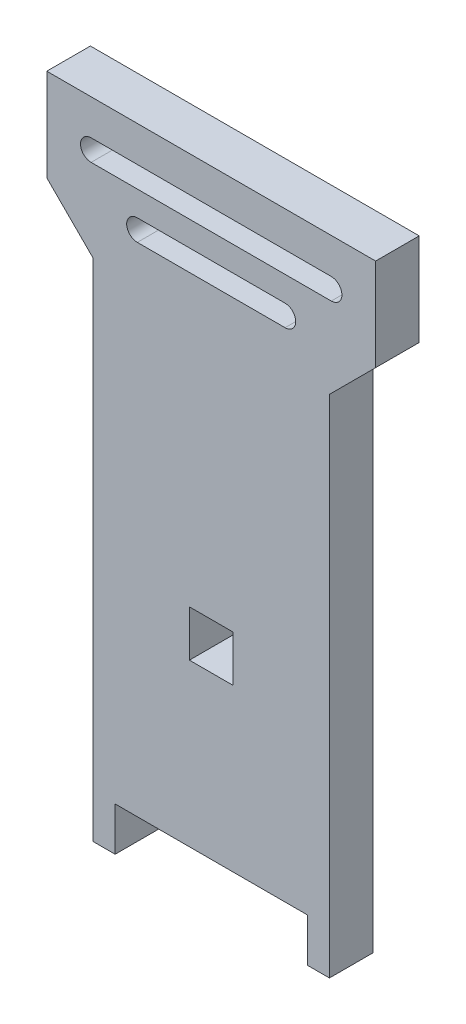
ISO-10303-21;
HEADER;
FILE_DESCRIPTION(('STEP AP214'),'2;1');
FILE_NAME('part.step','',(''),(''),'','','');
FILE_SCHEMA(('AUTOMOTIVE_DESIGN { 1 0 10303 214 1 1 1 1 }'));
ENDSEC;
DATA;
#1=APPLICATION_CONTEXT('core data for automotive mechanical design processes');
#2=APPLICATION_PROTOCOL_DEFINITION('international standard','automotive_design',2000,#1);
#3=PRODUCT_CONTEXT('',#1,'mechanical');
#4=PRODUCT('Part','Part','',(#3));
#5=PRODUCT_RELATED_PRODUCT_CATEGORY('part','',(#4));
#6=PRODUCT_DEFINITION_FORMATION('','',#4);
#7=PRODUCT_DEFINITION_CONTEXT('part definition',#1,'design');
#8=PRODUCT_DEFINITION('design','',#6,#7);
#9=PRODUCT_DEFINITION_SHAPE('','',#8);
#10=(LENGTH_UNIT() NAMED_UNIT(*) SI_UNIT(.MILLI.,.METRE.));
#11=(NAMED_UNIT(*) PLANE_ANGLE_UNIT() SI_UNIT($,.RADIAN.));
#12=(NAMED_UNIT(*) SI_UNIT($,.STERADIAN.) SOLID_ANGLE_UNIT());
#13=UNCERTAINTY_MEASURE_WITH_UNIT(LENGTH_MEASURE(1.E-05),#10,'distance_accuracy_value','');
#14=(GEOMETRIC_REPRESENTATION_CONTEXT(3) GLOBAL_UNCERTAINTY_ASSIGNED_CONTEXT((#13)) GLOBAL_UNIT_ASSIGNED_CONTEXT((#10,
#11,#12)) REPRESENTATION_CONTEXT('',''));
#15=CARTESIAN_POINT('',(0.,0.,0.));
#16=DIRECTION('',(0.,0.,1.));
#17=DIRECTION('',(1.,0.,0.));
#18=AXIS2_PLACEMENT_3D('',#15,#16,#17);
#19=CARTESIAN_POINT('',(0.,0.,5.9944));
#20=DIRECTION('',(0.,0.,-1.));
#21=DIRECTION('',(-1.,0.,0.));
#22=AXIS2_PLACEMENT_3D('',#19,#20,#21);
#23=PLANE('',#22);
#24=CARTESIAN_POINT('',(10.16,75.8444,5.9944));
#25=DIRECTION('',(0.,0.,1.));
#26=DIRECTION('',(1.,0.,0.));
#27=AXIS2_PLACEMENT_3D('',#24,#25,#26);
#28=CIRCLE('',#27,1.4605);
#29=CARTESIAN_POINT('',(10.16,74.3839,5.9944));
#30=VERTEX_POINT('',#29);
#31=CARTESIAN_POINT('',(10.16,77.3049,5.9944));
#32=VERTEX_POINT('',#31);
#33=EDGE_CURVE('E229',#30,#32,#28,.T.);
#34=ORIENTED_EDGE('',*,*,#33,.F.);
#35=DIRECTION('',(1.,0.,0.));
#36=VECTOR('',#35,1.);
#37=CARTESIAN_POINT('',(-10.16,74.3839,5.9944));
#38=LINE('',#37,#36);
#39=CARTESIAN_POINT('',(-10.16,74.3839,5.9944));
#40=VERTEX_POINT('',#39);
#41=EDGE_CURVE('E237',#40,#30,#38,.T.);
#42=ORIENTED_EDGE('',*,*,#41,.F.);
#43=CARTESIAN_POINT('',(-10.16,75.8444,5.9944));
#44=DIRECTION('',(0.,0.,1.));
#45=DIRECTION('',(-1.,0.,0.));
#46=AXIS2_PLACEMENT_3D('',#43,#44,#45);
#47=CIRCLE('',#46,1.4605);
#48=CARTESIAN_POINT('',(-10.16,77.3049,5.9944));
#49=VERTEX_POINT('',#48);
#50=EDGE_CURVE('E234',#49,#40,#47,.T.);
#51=ORIENTED_EDGE('',*,*,#50,.F.);
#52=DIRECTION('',(-1.,0.,0.));
#53=VECTOR('',#52,1.);
#54=CARTESIAN_POINT('',(-10.16,77.3049,5.9944));
#55=LINE('',#54,#53);
#56=EDGE_CURVE('E231',#32,#49,#55,.T.);
#57=ORIENTED_EDGE('',*,*,#56,.F.);
#58=EDGE_LOOP('',(#34,#42,#51,#57));
#59=FACE_BOUND('',#58,.T.);
#60=DIRECTION('',(1.,0.,0.));
#61=VECTOR('',#60,1.);
#62=CARTESIAN_POINT('',(13.208,5.9944,5.9944));
#63=LINE('',#62,#61);
#64=CARTESIAN_POINT('',(-13.208,5.9944,5.9944));
#65=VERTEX_POINT('',#64);
#66=CARTESIAN_POINT('',(13.208,5.9944,5.9944));
#67=VERTEX_POINT('',#66);
#68=EDGE_CURVE('E291',#65,#67,#63,.T.);
#69=ORIENTED_EDGE('',*,*,#68,.T.);
#70=DIRECTION('',(0.,-1.,0.));
#71=VECTOR('',#70,1.);
#72=CARTESIAN_POINT('',(13.208,0.,5.9944));
#73=LINE('',#72,#71);
#74=CARTESIAN_POINT('',(13.208,0.,5.9944));
#75=VERTEX_POINT('',#74);
#76=EDGE_CURVE('E294',#67,#75,#73,.T.);
#77=ORIENTED_EDGE('',*,*,#76,.T.);
#78=DIRECTION('',(1.,0.,0.));
#79=VECTOR('',#78,1.);
#80=CARTESIAN_POINT('',(16.256,0.,5.9944));
#81=LINE('',#80,#79);
#82=CARTESIAN_POINT('',(16.256,0.,5.9944));
#83=VERTEX_POINT('',#82);
#84=EDGE_CURVE('E297',#75,#83,#81,.T.);
#85=ORIENTED_EDGE('',*,*,#84,.T.);
#86=DIRECTION('',(0.,1.,0.));
#87=VECTOR('',#86,1.);
#88=CARTESIAN_POINT('',(16.256,0.,5.9944));
#89=LINE('',#88,#87);
#90=CARTESIAN_POINT('',(16.256,69.4944,5.9944));
#91=VERTEX_POINT('',#90);
#92=EDGE_CURVE('E299',#83,#91,#89,.T.);
#93=ORIENTED_EDGE('',*,*,#92,.T.);
#94=DIRECTION('',(0.707106781186546,0.707106781186549,0.));
#95=VECTOR('',#94,1.);
#96=CARTESIAN_POINT('',(16.256,69.4944,5.9944));
#97=LINE('',#96,#95);
#98=CARTESIAN_POINT('',(22.606,75.8444,5.9944));
#99=VERTEX_POINT('',#98);
#100=EDGE_CURVE('E301',#91,#99,#97,.T.);
#101=ORIENTED_EDGE('',*,*,#100,.T.);
#102=DIRECTION('',(0.,1.,0.));
#103=VECTOR('',#102,1.);
#104=CARTESIAN_POINT('',(22.606,75.8444,5.9944));
#105=LINE('',#104,#103);
#106=CARTESIAN_POINT('',(22.606,88.5444,5.9944));
#107=VERTEX_POINT('',#106);
#108=EDGE_CURVE('E303',#99,#107,#105,.T.);
#109=ORIENTED_EDGE('',*,*,#108,.T.);
#110=DIRECTION('',(-1.,0.,0.));
#111=VECTOR('',#110,1.);
#112=CARTESIAN_POINT('',(22.606,88.5444,5.9944));
#113=LINE('',#112,#111);
#114=CARTESIAN_POINT('',(-22.606,88.5444,5.9944));
#115=VERTEX_POINT('',#114);
#116=EDGE_CURVE('E305',#107,#115,#113,.T.);
#117=ORIENTED_EDGE('',*,*,#116,.T.);
#118=DIRECTION('',(0.,-1.,0.));
#119=VECTOR('',#118,1.);
#120=CARTESIAN_POINT('',(-22.606,75.8444,5.9944));
#121=LINE('',#120,#119);
#122=CARTESIAN_POINT('',(-22.606,75.8444,5.9944));
#123=VERTEX_POINT('',#122);
#124=EDGE_CURVE('E307',#115,#123,#121,.T.);
#125=ORIENTED_EDGE('',*,*,#124,.T.);
#126=DIRECTION('',(0.707106781186546,-0.707106781186549,0.));
#127=VECTOR('',#126,1.);
#128=CARTESIAN_POINT('',(-16.256,69.4944,5.9944));
#129=LINE('',#128,#127);
#130=CARTESIAN_POINT('',(-16.256,69.4944,5.9944));
#131=VERTEX_POINT('',#130);
#132=EDGE_CURVE('E309',#123,#131,#129,.T.);
#133=ORIENTED_EDGE('',*,*,#132,.T.);
#134=DIRECTION('',(0.,-1.,0.));
#135=VECTOR('',#134,1.);
#136=CARTESIAN_POINT('',(-16.256,0.,5.9944));
#137=LINE('',#136,#135);
#138=CARTESIAN_POINT('',(-16.256,0.,5.9944));
#139=VERTEX_POINT('',#138);
#140=EDGE_CURVE('E311',#131,#139,#137,.T.);
#141=ORIENTED_EDGE('',*,*,#140,.T.);
#142=DIRECTION('',(1.,0.,0.));
#143=VECTOR('',#142,1.);
#144=CARTESIAN_POINT('',(-16.256,0.,5.9944));
#145=LINE('',#144,#143);
#146=CARTESIAN_POINT('',(-13.208,0.,5.9944));
#147=VERTEX_POINT('',#146);
#148=EDGE_CURVE('E313',#139,#147,#145,.T.);
#149=ORIENTED_EDGE('',*,*,#148,.T.);
#150=DIRECTION('',(0.,1.,0.));
#151=VECTOR('',#150,1.);
#152=CARTESIAN_POINT('',(-13.208,0.,5.9944));
#153=LINE('',#152,#151);
#154=EDGE_CURVE('E315',#147,#65,#153,.T.);
#155=ORIENTED_EDGE('',*,*,#154,.T.);
#156=EDGE_LOOP('',(#69,#77,#85,#93,#101,#109,#117,#125,#133,#141,#149,#155));
#157=FACE_BOUND('',#156,.T.);
#158=DIRECTION('',(0.,1.,0.));
#159=VECTOR('',#158,1.);
#160=CARTESIAN_POINT('',(2.99719999999999,34.5694,5.9944));
#161=LINE('',#160,#159);
#162=CARTESIAN_POINT('',(2.9972,28.2194,5.9944));
#163=VERTEX_POINT('',#162);
#164=CARTESIAN_POINT('',(2.99719999999999,34.5694,5.9944));
#165=VERTEX_POINT('',#164);
#166=EDGE_CURVE('E260',#163,#165,#161,.T.);
#167=ORIENTED_EDGE('',*,*,#166,.F.);
#168=DIRECTION('',(1.,0.,0.));
#169=VECTOR('',#168,1.);
#170=CARTESIAN_POINT('',(2.9972,28.2194,5.9944));
#171=LINE('',#170,#169);
#172=CARTESIAN_POINT('',(-2.9972,28.2194,5.9944));
#173=VERTEX_POINT('',#172);
#174=EDGE_CURVE('E268',#173,#163,#171,.T.);
#175=ORIENTED_EDGE('',*,*,#174,.F.);
#176=DIRECTION('',(0.,-1.,0.));
#177=VECTOR('',#176,1.);
#178=CARTESIAN_POINT('',(-2.99719999999999,34.5694,5.9944));
#179=LINE('',#178,#177);
#180=CARTESIAN_POINT('',(-2.99719999999999,34.5694,5.9944));
#181=VERTEX_POINT('',#180);
#182=EDGE_CURVE('E265',#181,#173,#179,.T.);
#183=ORIENTED_EDGE('',*,*,#182,.F.);
#184=DIRECTION('',(-1.,0.,0.));
#185=VECTOR('',#184,1.);
#186=CARTESIAN_POINT('',(-2.99719999999999,34.5694,5.9944));
#187=LINE('',#186,#185);
#188=EDGE_CURVE('E262',#165,#181,#187,.T.);
#189=ORIENTED_EDGE('',*,*,#188,.F.);
#190=EDGE_LOOP('',(#167,#175,#183,#189));
#191=FACE_BOUND('',#190,.T.);
#192=CARTESIAN_POINT('',(16.51,82.1944,5.9944));
#193=DIRECTION('',(0.,0.,1.));
#194=DIRECTION('',(1.,0.,0.));
#195=AXIS2_PLACEMENT_3D('',#192,#193,#194);
#196=CIRCLE('',#195,1.4605);
#197=CARTESIAN_POINT('',(16.51,80.7339,5.9944));
#198=VERTEX_POINT('',#197);
#199=CARTESIAN_POINT('',(16.51,83.6549,5.9944));
#200=VERTEX_POINT('',#199);
#201=EDGE_CURVE('E193',#198,#200,#196,.T.);
#202=ORIENTED_EDGE('',*,*,#201,.F.);
#203=DIRECTION('',(1.,0.,0.));
#204=VECTOR('',#203,1.);
#205=CARTESIAN_POINT('',(-16.51,80.7339,5.9944));
#206=LINE('',#205,#204);
#207=CARTESIAN_POINT('',(-16.51,80.7339,5.9944));
#208=VERTEX_POINT('',#207);
#209=EDGE_CURVE('E215',#208,#198,#206,.T.);
#210=ORIENTED_EDGE('',*,*,#209,.F.);
#211=CARTESIAN_POINT('',(-16.51,82.1944,5.9944));
#212=DIRECTION('',(0.,0.,1.));
#213=DIRECTION('',(-1.,0.,0.));
#214=AXIS2_PLACEMENT_3D('',#211,#212,#213);
#215=CIRCLE('',#214,1.4605);
#216=CARTESIAN_POINT('',(-16.51,83.6549,5.9944));
#217=VERTEX_POINT('',#216);
#218=EDGE_CURVE('E213',#217,#208,#215,.T.);
#219=ORIENTED_EDGE('',*,*,#218,.F.);
#220=DIRECTION('',(-1.,0.,0.));
#221=VECTOR('',#220,1.);
#222=CARTESIAN_POINT('',(-16.51,83.6549,5.9944));
#223=LINE('',#222,#221);
#224=EDGE_CURVE('E201',#200,#217,#223,.T.);
#225=ORIENTED_EDGE('',*,*,#224,.F.);
#226=EDGE_LOOP('',(#202,#210,#219,#225));
#227=FACE_BOUND('',#226,.T.);
#228=ADVANCED_FACE('F32',(#59,#157,#191,#227),#23,.F.);
#229=CARTESIAN_POINT('',(0.,0.,0.));
#230=DIRECTION('',(0.,0.,-1.));
#231=DIRECTION('',(-1.,0.,0.));
#232=AXIS2_PLACEMENT_3D('',#229,#230,#231);
#233=PLANE('',#232);
#234=DIRECTION('',(1.,0.,0.));
#235=VECTOR('',#234,1.);
#236=CARTESIAN_POINT('',(13.208,5.9944,0.));
#237=LINE('',#236,#235);
#238=CARTESIAN_POINT('',(-13.208,5.9944,0.));
#239=VERTEX_POINT('',#238);
#240=CARTESIAN_POINT('',(13.208,5.9944,0.));
#241=VERTEX_POINT('',#240);
#242=EDGE_CURVE('E290',#239,#241,#237,.T.);
#243=ORIENTED_EDGE('',*,*,#242,.F.);
#244=DIRECTION('',(0.,1.,0.));
#245=VECTOR('',#244,1.);
#246=CARTESIAN_POINT('',(-13.208,0.,0.));
#247=LINE('',#246,#245);
#248=CARTESIAN_POINT('',(-13.208,0.,0.));
#249=VERTEX_POINT('',#248);
#250=EDGE_CURVE('E295',#249,#239,#247,.T.);
#251=ORIENTED_EDGE('',*,*,#250,.F.);
#252=DIRECTION('',(1.,0.,0.));
#253=VECTOR('',#252,1.);
#254=CARTESIAN_POINT('',(-16.256,0.,0.));
#255=LINE('',#254,#253);
#256=CARTESIAN_POINT('',(-16.256,0.,0.));
#257=VERTEX_POINT('',#256);
#258=EDGE_CURVE('E338',#257,#249,#255,.T.);
#259=ORIENTED_EDGE('',*,*,#258,.F.);
#260=DIRECTION('',(0.,-1.,0.));
#261=VECTOR('',#260,1.);
#262=CARTESIAN_POINT('',(-16.256,0.,0.));
#263=LINE('',#262,#261);
#264=CARTESIAN_POINT('',(-16.256,69.4944,0.));
#265=VERTEX_POINT('',#264);
#266=EDGE_CURVE('E336',#265,#257,#263,.T.);
#267=ORIENTED_EDGE('',*,*,#266,.F.);
#268=DIRECTION('',(0.707106781186546,-0.707106781186549,0.));
#269=VECTOR('',#268,1.);
#270=CARTESIAN_POINT('',(-16.256,69.4944,0.));
#271=LINE('',#270,#269);
#272=CARTESIAN_POINT('',(-22.606,75.8444,0.));
#273=VERTEX_POINT('',#272);
#274=EDGE_CURVE('E334',#273,#265,#271,.T.);
#275=ORIENTED_EDGE('',*,*,#274,.F.);
#276=DIRECTION('',(0.,-1.,0.));
#277=VECTOR('',#276,1.);
#278=CARTESIAN_POINT('',(-22.606,75.8444,0.));
#279=LINE('',#278,#277);
#280=CARTESIAN_POINT('',(-22.606,88.5444,0.));
#281=VERTEX_POINT('',#280);
#282=EDGE_CURVE('E332',#281,#273,#279,.T.);
#283=ORIENTED_EDGE('',*,*,#282,.F.);
#284=DIRECTION('',(-1.,0.,0.));
#285=VECTOR('',#284,1.);
#286=CARTESIAN_POINT('',(22.606,88.5444,0.));
#287=LINE('',#286,#285);
#288=CARTESIAN_POINT('',(22.606,88.5444,0.));
#289=VERTEX_POINT('',#288);
#290=EDGE_CURVE('E330',#289,#281,#287,.T.);
#291=ORIENTED_EDGE('',*,*,#290,.F.);
#292=DIRECTION('',(0.,1.,0.));
#293=VECTOR('',#292,1.);
#294=CARTESIAN_POINT('',(22.606,75.8444,0.));
#295=LINE('',#294,#293);
#296=CARTESIAN_POINT('',(22.606,75.8444,0.));
#297=VERTEX_POINT('',#296);
#298=EDGE_CURVE('E328',#297,#289,#295,.T.);
#299=ORIENTED_EDGE('',*,*,#298,.F.);
#300=DIRECTION('',(0.707106781186546,0.707106781186549,0.));
#301=VECTOR('',#300,1.);
#302=CARTESIAN_POINT('',(16.256,69.4944,0.));
#303=LINE('',#302,#301);
#304=CARTESIAN_POINT('',(16.256,69.4944,0.));
#305=VERTEX_POINT('',#304);
#306=EDGE_CURVE('E326',#305,#297,#303,.T.);
#307=ORIENTED_EDGE('',*,*,#306,.F.);
#308=DIRECTION('',(0.,1.,0.));
#309=VECTOR('',#308,1.);
#310=CARTESIAN_POINT('',(16.256,0.,0.));
#311=LINE('',#310,#309);
#312=CARTESIAN_POINT('',(16.256,0.,0.));
#313=VERTEX_POINT('',#312);
#314=EDGE_CURVE('E324',#313,#305,#311,.T.);
#315=ORIENTED_EDGE('',*,*,#314,.F.);
#316=DIRECTION('',(1.,0.,0.));
#317=VECTOR('',#316,1.);
#318=CARTESIAN_POINT('',(16.256,0.,0.));
#319=LINE('',#318,#317);
#320=CARTESIAN_POINT('',(13.208,0.,0.));
#321=VERTEX_POINT('',#320);
#322=EDGE_CURVE('E322',#321,#313,#319,.T.);
#323=ORIENTED_EDGE('',*,*,#322,.F.);
#324=DIRECTION('',(0.,-1.,0.));
#325=VECTOR('',#324,1.);
#326=CARTESIAN_POINT('',(13.208,0.,0.));
#327=LINE('',#326,#325);
#328=EDGE_CURVE('E320',#241,#321,#327,.T.);
#329=ORIENTED_EDGE('',*,*,#328,.F.);
#330=EDGE_LOOP('',(#243,#251,#259,#267,#275,#283,#291,#299,#307,#315,#323,#329));
#331=FACE_BOUND('',#330,.T.);
#332=DIRECTION('',(1.,0.,0.));
#333=VECTOR('',#332,1.);
#334=CARTESIAN_POINT('',(2.9972,28.2194,0.));
#335=LINE('',#334,#333);
#336=CARTESIAN_POINT('',(-2.9972,28.2194,0.));
#337=VERTEX_POINT('',#336);
#338=CARTESIAN_POINT('',(2.9972,28.2194,0.));
#339=VERTEX_POINT('',#338);
#340=EDGE_CURVE('E263',#337,#339,#335,.T.);
#341=ORIENTED_EDGE('',*,*,#340,.T.);
#342=DIRECTION('',(0.,1.,0.));
#343=VECTOR('',#342,1.);
#344=CARTESIAN_POINT('',(2.99719999999999,34.5694,0.));
#345=LINE('',#344,#343);
#346=CARTESIAN_POINT('',(2.99719999999999,34.5694,0.));
#347=VERTEX_POINT('',#346);
#348=EDGE_CURVE('E259',#339,#347,#345,.T.);
#349=ORIENTED_EDGE('',*,*,#348,.T.);
#350=DIRECTION('',(-1.,0.,0.));
#351=VECTOR('',#350,1.);
#352=CARTESIAN_POINT('',(-2.99719999999999,34.5694,0.));
#353=LINE('',#352,#351);
#354=CARTESIAN_POINT('',(-2.99719999999999,34.5694,0.));
#355=VERTEX_POINT('',#354);
#356=EDGE_CURVE('E273',#347,#355,#353,.T.);
#357=ORIENTED_EDGE('',*,*,#356,.T.);
#358=DIRECTION('',(0.,-1.,0.));
#359=VECTOR('',#358,1.);
#360=CARTESIAN_POINT('',(-2.99719999999999,34.5694,0.));
#361=LINE('',#360,#359);
#362=EDGE_CURVE('E276',#355,#337,#361,.T.);
#363=ORIENTED_EDGE('',*,*,#362,.T.);
#364=EDGE_LOOP('',(#341,#349,#357,#363));
#365=FACE_BOUND('',#364,.T.);
#366=DIRECTION('',(1.,0.,0.));
#367=VECTOR('',#366,1.);
#368=CARTESIAN_POINT('',(-10.16,74.3839,0.));
#369=LINE('',#368,#367);
#370=CARTESIAN_POINT('',(-10.16,74.3839,0.));
#371=VERTEX_POINT('',#370);
#372=CARTESIAN_POINT('',(10.16,74.3839,0.));
#373=VERTEX_POINT('',#372);
#374=EDGE_CURVE('E232',#371,#373,#369,.T.);
#375=ORIENTED_EDGE('',*,*,#374,.T.);
#376=CARTESIAN_POINT('',(10.16,75.8444,0.));
#377=DIRECTION('',(0.,0.,1.));
#378=DIRECTION('',(1.,0.,0.));
#379=AXIS2_PLACEMENT_3D('',#376,#377,#378);
#380=CIRCLE('',#379,1.4605);
#381=CARTESIAN_POINT('',(10.16,77.3049,0.));
#382=VERTEX_POINT('',#381);
#383=EDGE_CURVE('E209',#373,#382,#380,.T.);
#384=ORIENTED_EDGE('',*,*,#383,.T.);
#385=DIRECTION('',(-1.,0.,0.));
#386=VECTOR('',#385,1.);
#387=CARTESIAN_POINT('',(-10.16,77.3049,0.));
#388=LINE('',#387,#386);
#389=CARTESIAN_POINT('',(-10.16,77.3049,0.));
#390=VERTEX_POINT('',#389);
#391=EDGE_CURVE('E242',#382,#390,#388,.T.);
#392=ORIENTED_EDGE('',*,*,#391,.T.);
#393=CARTESIAN_POINT('',(-10.16,75.8444,0.));
#394=DIRECTION('',(0.,0.,1.));
#395=DIRECTION('',(-1.,0.,0.));
#396=AXIS2_PLACEMENT_3D('',#393,#394,#395);
#397=CIRCLE('',#396,1.4605);
#398=EDGE_CURVE('E245',#390,#371,#397,.T.);
#399=ORIENTED_EDGE('',*,*,#398,.T.);
#400=EDGE_LOOP('',(#375,#384,#392,#399));
#401=FACE_BOUND('',#400,.T.);
#402=DIRECTION('',(1.,0.,0.));
#403=VECTOR('',#402,1.);
#404=CARTESIAN_POINT('',(-16.51,80.7339,0.));
#405=LINE('',#404,#403);
#406=CARTESIAN_POINT('',(-16.51,80.7339,0.));
#407=VERTEX_POINT('',#406);
#408=CARTESIAN_POINT('',(16.51,80.7339,0.));
#409=VERTEX_POINT('',#408);
#410=EDGE_CURVE('E202',#407,#409,#405,.T.);
#411=ORIENTED_EDGE('',*,*,#410,.T.);
#412=CARTESIAN_POINT('',(16.51,82.1944,0.));
#413=DIRECTION('',(0.,0.,1.));
#414=DIRECTION('',(1.,0.,0.));
#415=AXIS2_PLACEMENT_3D('',#412,#413,#414);
#416=CIRCLE('',#415,1.4605);
#417=CARTESIAN_POINT('',(16.51,83.6549,0.));
#418=VERTEX_POINT('',#417);
#419=EDGE_CURVE('E55',#409,#418,#416,.T.);
#420=ORIENTED_EDGE('',*,*,#419,.T.);
#421=DIRECTION('',(-1.,0.,0.));
#422=VECTOR('',#421,1.);
#423=CARTESIAN_POINT('',(-16.51,83.6549,0.));
#424=LINE('',#423,#422);
#425=CARTESIAN_POINT('',(-16.51,83.6549,0.));
#426=VERTEX_POINT('',#425);
#427=EDGE_CURVE('E208',#418,#426,#424,.T.);
#428=ORIENTED_EDGE('',*,*,#427,.T.);
#429=CARTESIAN_POINT('',(-16.51,82.1944,0.));
#430=DIRECTION('',(0.,0.,1.));
#431=DIRECTION('',(-1.,0.,0.));
#432=AXIS2_PLACEMENT_3D('',#429,#430,#431);
#433=CIRCLE('',#432,1.4605);
#434=EDGE_CURVE('E221',#426,#407,#433,.T.);
#435=ORIENTED_EDGE('',*,*,#434,.T.);
#436=EDGE_LOOP('',(#411,#420,#428,#435));
#437=FACE_BOUND('',#436,.T.);
#438=ADVANCED_FACE('F380',(#331,#365,#401,#437),#233,.T.);
#439=CARTESIAN_POINT('',(13.208,5.9944,5.9944));
#440=DIRECTION('',(0.,1.,0.));
#441=DIRECTION('',(-1.,0.,0.));
#442=AXIS2_PLACEMENT_3D('',#439,#440,#441);
#443=PLANE('',#442);
#444=ORIENTED_EDGE('',*,*,#242,.T.);
#445=DIRECTION('',(0.,0.,-1.));
#446=VECTOR('',#445,1.);
#447=CARTESIAN_POINT('',(13.208,5.9944,5.9944));
#448=LINE('',#447,#446);
#449=EDGE_CURVE('E11',#67,#241,#448,.T.);
#450=ORIENTED_EDGE('',*,*,#449,.F.);
#451=ORIENTED_EDGE('',*,*,#68,.F.);
#452=DIRECTION('',(0.,0.,-1.));
#453=VECTOR('',#452,1.);
#454=CARTESIAN_POINT('',(-13.208,5.9944,5.9944));
#455=LINE('',#454,#453);
#456=EDGE_CURVE('E317',#65,#239,#455,.T.);
#457=ORIENTED_EDGE('',*,*,#456,.T.);
#458=EDGE_LOOP('',(#444,#450,#451,#457));
#459=FACE_BOUND('',#458,.T.);
#460=ADVANCED_FACE('F34',(#459),#443,.F.);
#461=CARTESIAN_POINT('',(13.208,0.,5.9944));
#462=DIRECTION('',(1.,0.,0.));
#463=DIRECTION('',(0.,0.,-1.));
#464=AXIS2_PLACEMENT_3D('',#461,#462,#463);
#465=PLANE('',#464);
#466=ORIENTED_EDGE('',*,*,#328,.T.);
#467=DIRECTION('',(0.,0.,-1.));
#468=VECTOR('',#467,1.);
#469=CARTESIAN_POINT('',(13.208,0.,5.9944));
#470=LINE('',#469,#468);
#471=EDGE_CURVE('E40',#75,#321,#470,.T.);
#472=ORIENTED_EDGE('',*,*,#471,.F.);
#473=ORIENTED_EDGE('',*,*,#76,.F.);
#474=ORIENTED_EDGE('',*,*,#449,.T.);
#475=EDGE_LOOP('',(#466,#472,#473,#474));
#476=FACE_BOUND('',#475,.T.);
#477=ADVANCED_FACE('F398',(#476),#465,.F.);
#478=CARTESIAN_POINT('',(16.256,0.,5.9944));
#479=DIRECTION('',(0.,1.,0.));
#480=DIRECTION('',(-1.,0.,0.));
#481=AXIS2_PLACEMENT_3D('',#478,#479,#480);
#482=PLANE('',#481);
#483=ORIENTED_EDGE('',*,*,#322,.T.);
#484=DIRECTION('',(0.,0.,-1.));
#485=VECTOR('',#484,1.);
#486=CARTESIAN_POINT('',(16.256,0.,5.9944));
#487=LINE('',#486,#485);
#488=EDGE_CURVE('E367',#83,#313,#487,.T.);
#489=ORIENTED_EDGE('',*,*,#488,.F.);
#490=ORIENTED_EDGE('',*,*,#84,.F.);
#491=ORIENTED_EDGE('',*,*,#471,.T.);
#492=EDGE_LOOP('',(#483,#489,#490,#491));
#493=FACE_BOUND('',#492,.T.);
#494=ADVANCED_FACE('F374',(#493),#482,.F.);
#495=CARTESIAN_POINT('',(16.256,0.,5.9944));
#496=DIRECTION('',(-1.,0.,0.));
#497=DIRECTION('',(0.,0.,1.));
#498=AXIS2_PLACEMENT_3D('',#495,#496,#497);
#499=PLANE('',#498);
#500=ORIENTED_EDGE('',*,*,#314,.T.);
#501=DIRECTION('',(0.,0.,-1.));
#502=VECTOR('',#501,1.);
#503=CARTESIAN_POINT('',(16.256,69.4944,5.9944));
#504=LINE('',#503,#502);
#505=EDGE_CURVE('E364',#91,#305,#504,.T.);
#506=ORIENTED_EDGE('',*,*,#505,.F.);
#507=ORIENTED_EDGE('',*,*,#92,.F.);
#508=ORIENTED_EDGE('',*,*,#488,.T.);
#509=EDGE_LOOP('',(#500,#506,#507,#508));
#510=FACE_BOUND('',#509,.T.);
#511=ADVANCED_FACE('F386',(#510),#499,.F.);
#512=CARTESIAN_POINT('',(16.256,69.4944,5.9944));
#513=DIRECTION('',(-0.707106781186549,0.707106781186546,0.));
#514=DIRECTION('',(-0.707106781186546,-0.707106781186549,0.));
#515=AXIS2_PLACEMENT_3D('',#512,#513,#514);
#516=PLANE('',#515);
#517=ORIENTED_EDGE('',*,*,#306,.T.);
#518=DIRECTION('',(0.,0.,-1.));
#519=VECTOR('',#518,1.);
#520=CARTESIAN_POINT('',(22.606,75.8444,5.9944));
#521=LINE('',#520,#519);
#522=EDGE_CURVE('E361',#99,#297,#521,.T.);
#523=ORIENTED_EDGE('',*,*,#522,.F.);
#524=ORIENTED_EDGE('',*,*,#100,.F.);
#525=ORIENTED_EDGE('',*,*,#505,.T.);
#526=EDGE_LOOP('',(#517,#523,#524,#525));
#527=FACE_BOUND('',#526,.T.);
#528=ADVANCED_FACE('F390',(#527),#516,.F.);
#529=CARTESIAN_POINT('',(22.606,75.8444,5.9944));
#530=DIRECTION('',(-1.,0.,0.));
#531=DIRECTION('',(0.,0.,1.));
#532=AXIS2_PLACEMENT_3D('',#529,#530,#531);
#533=PLANE('',#532);
#534=ORIENTED_EDGE('',*,*,#298,.T.);
#535=DIRECTION('',(0.,0.,-1.));
#536=VECTOR('',#535,1.);
#537=CARTESIAN_POINT('',(22.606,88.5444,5.9944));
#538=LINE('',#537,#536);
#539=EDGE_CURVE('E358',#107,#289,#538,.T.);
#540=ORIENTED_EDGE('',*,*,#539,.F.);
#541=ORIENTED_EDGE('',*,*,#108,.F.);
#542=ORIENTED_EDGE('',*,*,#522,.T.);
#543=EDGE_LOOP('',(#534,#540,#541,#542));
#544=FACE_BOUND('',#543,.T.);
#545=ADVANCED_FACE('F431',(#544),#533,.F.);
#546=CARTESIAN_POINT('',(22.606,88.5444,5.9944));
#547=DIRECTION('',(0.,-1.,0.));
#548=DIRECTION('',(0.,0.,-1.));
#549=AXIS2_PLACEMENT_3D('',#546,#547,#548);
#550=PLANE('',#549);
#551=ORIENTED_EDGE('',*,*,#290,.T.);
#552=DIRECTION('',(0.,0.,-1.));
#553=VECTOR('',#552,1.);
#554=CARTESIAN_POINT('',(-22.606,88.5444,5.9944));
#555=LINE('',#554,#553);
#556=EDGE_CURVE('E355',#115,#281,#555,.T.);
#557=ORIENTED_EDGE('',*,*,#556,.F.);
#558=ORIENTED_EDGE('',*,*,#116,.F.);
#559=ORIENTED_EDGE('',*,*,#539,.T.);
#560=EDGE_LOOP('',(#551,#557,#558,#559));
#561=FACE_BOUND('',#560,.T.);
#562=ADVANCED_FACE('F429',(#561),#550,.F.);
#563=CARTESIAN_POINT('',(-22.606,75.8444,5.9944));
#564=DIRECTION('',(1.,0.,0.));
#565=DIRECTION('',(0.,0.,-1.));
#566=AXIS2_PLACEMENT_3D('',#563,#564,#565);
#567=PLANE('',#566);
#568=ORIENTED_EDGE('',*,*,#282,.T.);
#569=DIRECTION('',(0.,0.,-1.));
#570=VECTOR('',#569,1.);
#571=CARTESIAN_POINT('',(-22.606,75.8444,5.9944));
#572=LINE('',#571,#570);
#573=EDGE_CURVE('E352',#123,#273,#572,.T.);
#574=ORIENTED_EDGE('',*,*,#573,.F.);
#575=ORIENTED_EDGE('',*,*,#124,.F.);
#576=ORIENTED_EDGE('',*,*,#556,.T.);
#577=EDGE_LOOP('',(#568,#574,#575,#576));
#578=FACE_BOUND('',#577,.T.);
#579=ADVANCED_FACE('F425',(#578),#567,.F.);
#580=CARTESIAN_POINT('',(-16.256,69.4944,5.9944));
#581=DIRECTION('',(0.707106781186549,0.707106781186546,0.));
#582=DIRECTION('',(-0.707106781186546,0.707106781186549,0.));
#583=AXIS2_PLACEMENT_3D('',#580,#581,#582);
#584=PLANE('',#583);
#585=ORIENTED_EDGE('',*,*,#274,.T.);
#586=DIRECTION('',(0.,0.,-1.));
#587=VECTOR('',#586,1.);
#588=CARTESIAN_POINT('',(-16.256,69.4944,5.9944));
#589=LINE('',#588,#587);
#590=EDGE_CURVE('E349',#131,#265,#589,.T.);
#591=ORIENTED_EDGE('',*,*,#590,.F.);
#592=ORIENTED_EDGE('',*,*,#132,.F.);
#593=ORIENTED_EDGE('',*,*,#573,.T.);
#594=EDGE_LOOP('',(#585,#591,#592,#593));
#595=FACE_BOUND('',#594,.T.);
#596=ADVANCED_FACE('F420',(#595),#584,.F.);
#597=CARTESIAN_POINT('',(-16.256,0.,5.9944));
#598=DIRECTION('',(1.,0.,0.));
#599=DIRECTION('',(0.,0.,-1.));
#600=AXIS2_PLACEMENT_3D('',#597,#598,#599);
#601=PLANE('',#600);
#602=ORIENTED_EDGE('',*,*,#266,.T.);
#603=DIRECTION('',(0.,0.,-1.));
#604=VECTOR('',#603,1.);
#605=CARTESIAN_POINT('',(-16.256,0.,5.9944));
#606=LINE('',#605,#604);
#607=EDGE_CURVE('E346',#139,#257,#606,.T.);
#608=ORIENTED_EDGE('',*,*,#607,.F.);
#609=ORIENTED_EDGE('',*,*,#140,.F.);
#610=ORIENTED_EDGE('',*,*,#590,.T.);
#611=EDGE_LOOP('',(#602,#608,#609,#610));
#612=FACE_BOUND('',#611,.T.);
#613=ADVANCED_FACE('F414',(#612),#601,.F.);
#614=CARTESIAN_POINT('',(-16.256,0.,5.9944));
#615=DIRECTION('',(0.,1.,0.));
#616=DIRECTION('',(0.,0.,1.));
#617=AXIS2_PLACEMENT_3D('',#614,#615,#616);
#618=PLANE('',#617);
#619=ORIENTED_EDGE('',*,*,#258,.T.);
#620=DIRECTION('',(0.,0.,-1.));
#621=VECTOR('',#620,1.);
#622=CARTESIAN_POINT('',(-13.208,0.,5.9944));
#623=LINE('',#622,#621);
#624=EDGE_CURVE('E343',#147,#249,#623,.T.);
#625=ORIENTED_EDGE('',*,*,#624,.F.);
#626=ORIENTED_EDGE('',*,*,#148,.F.);
#627=ORIENTED_EDGE('',*,*,#607,.T.);
#628=EDGE_LOOP('',(#619,#625,#626,#627));
#629=FACE_BOUND('',#628,.T.);
#630=ADVANCED_FACE('F410',(#629),#618,.F.);
#631=CARTESIAN_POINT('',(-13.208,0.,5.9944));
#632=DIRECTION('',(-1.,0.,0.));
#633=DIRECTION('',(0.,0.,1.));
#634=AXIS2_PLACEMENT_3D('',#631,#632,#633);
#635=PLANE('',#634);
#636=ORIENTED_EDGE('',*,*,#250,.T.);
#637=ORIENTED_EDGE('',*,*,#456,.F.);
#638=ORIENTED_EDGE('',*,*,#154,.F.);
#639=ORIENTED_EDGE('',*,*,#624,.T.);
#640=EDGE_LOOP('',(#636,#637,#638,#639));
#641=FACE_BOUND('',#640,.T.);
#642=ADVANCED_FACE('F405',(#641),#635,.F.);
#643=CARTESIAN_POINT('',(2.99719999999999,34.5694,5.9944));
#644=DIRECTION('',(-1.,0.,0.));
#645=DIRECTION('',(0.,-1.,0.));
#646=AXIS2_PLACEMENT_3D('',#643,#644,#645);
#647=PLANE('',#646);
#648=ORIENTED_EDGE('',*,*,#348,.F.);
#649=DIRECTION('',(0.,0.,-1.));
#650=VECTOR('',#649,1.);
#651=CARTESIAN_POINT('',(2.9972,28.2194,5.9944));
#652=LINE('',#651,#650);
#653=EDGE_CURVE('E270',#163,#339,#652,.T.);
#654=ORIENTED_EDGE('',*,*,#653,.F.);
#655=ORIENTED_EDGE('',*,*,#166,.T.);
#656=DIRECTION('',(0.,0.,-1.));
#657=VECTOR('',#656,1.);
#658=CARTESIAN_POINT('',(2.99719999999999,34.5694,5.9944));
#659=LINE('',#658,#657);
#660=EDGE_CURVE('E287',#165,#347,#659,.T.);
#661=ORIENTED_EDGE('',*,*,#660,.T.);
#662=EDGE_LOOP('',(#648,#654,#655,#661));
#663=FACE_BOUND('',#662,.T.);
#664=ADVANCED_FACE('F449',(#663),#647,.T.);
#665=CARTESIAN_POINT('',(-2.99719999999999,34.5694,5.9944));
#666=DIRECTION('',(0.,-1.,0.));
#667=DIRECTION('',(1.,0.,0.));
#668=AXIS2_PLACEMENT_3D('',#665,#666,#667);
#669=PLANE('',#668);
#670=ORIENTED_EDGE('',*,*,#356,.F.);
#671=ORIENTED_EDGE('',*,*,#660,.F.);
#672=ORIENTED_EDGE('',*,*,#188,.T.);
#673=DIRECTION('',(0.,0.,-1.));
#674=VECTOR('',#673,1.);
#675=CARTESIAN_POINT('',(-2.99719999999999,34.5694,5.9944));
#676=LINE('',#675,#674);
#677=EDGE_CURVE('E285',#181,#355,#676,.T.);
#678=ORIENTED_EDGE('',*,*,#677,.T.);
#679=EDGE_LOOP('',(#670,#671,#672,#678));
#680=FACE_BOUND('',#679,.T.);
#681=ADVANCED_FACE('F487',(#680),#669,.T.);
#682=CARTESIAN_POINT('',(-2.99719999999999,34.5694,5.9944));
#683=DIRECTION('',(1.,0.,0.));
#684=DIRECTION('',(0.,1.,0.));
#685=AXIS2_PLACEMENT_3D('',#682,#683,#684);
#686=PLANE('',#685);
#687=ORIENTED_EDGE('',*,*,#362,.F.);
#688=ORIENTED_EDGE('',*,*,#677,.F.);
#689=ORIENTED_EDGE('',*,*,#182,.T.);
#690=DIRECTION('',(0.,0.,-1.));
#691=VECTOR('',#690,1.);
#692=CARTESIAN_POINT('',(-2.9972,28.2194,5.9944));
#693=LINE('',#692,#691);
#694=EDGE_CURVE('E283',#173,#337,#693,.T.);
#695=ORIENTED_EDGE('',*,*,#694,.T.);
#696=EDGE_LOOP('',(#687,#688,#689,#695));
#697=FACE_BOUND('',#696,.T.);
#698=ADVANCED_FACE('F494',(#697),#686,.T.);
#699=CARTESIAN_POINT('',(2.9972,28.2194,5.9944));
#700=DIRECTION('',(0.,1.,0.));
#701=DIRECTION('',(-1.,0.,0.));
#702=AXIS2_PLACEMENT_3D('',#699,#700,#701);
#703=PLANE('',#702);
#704=ORIENTED_EDGE('',*,*,#340,.F.);
#705=ORIENTED_EDGE('',*,*,#694,.F.);
#706=ORIENTED_EDGE('',*,*,#174,.T.);
#707=ORIENTED_EDGE('',*,*,#653,.T.);
#708=EDGE_LOOP('',(#704,#705,#706,#707));
#709=FACE_BOUND('',#708,.T.);
#710=ADVANCED_FACE('F501',(#709),#703,.T.);
#711=CARTESIAN_POINT('',(10.16,75.8444,5.9944));
#712=DIRECTION('',(0.,0.,-1.));
#713=DIRECTION('',(-1.,0.,0.));
#714=AXIS2_PLACEMENT_3D('',#711,#712,#713);
#715=CYLINDRICAL_SURFACE('',#714,1.4605);
#716=ORIENTED_EDGE('',*,*,#383,.F.);
#717=DIRECTION('',(0.,0.,-1.));
#718=VECTOR('',#717,1.);
#719=CARTESIAN_POINT('',(10.16,74.3839,5.9944));
#720=LINE('',#719,#718);
#721=EDGE_CURVE('E239',#30,#373,#720,.T.);
#722=ORIENTED_EDGE('',*,*,#721,.F.);
#723=ORIENTED_EDGE('',*,*,#33,.T.);
#724=DIRECTION('',(0.,0.,-1.));
#725=VECTOR('',#724,1.);
#726=CARTESIAN_POINT('',(10.16,77.3049,5.9944));
#727=LINE('',#726,#725);
#728=EDGE_CURVE('E256',#32,#382,#727,.T.);
#729=ORIENTED_EDGE('',*,*,#728,.T.);
#730=EDGE_LOOP('',(#716,#722,#723,#729));
#731=FACE_BOUND('',#730,.T.);
#732=ADVANCED_FACE('F509',(#731),#715,.F.);
#733=CARTESIAN_POINT('',(-10.16,77.3049,5.9944));
#734=DIRECTION('',(0.,-1.,0.));
#735=DIRECTION('',(0.,0.,-1.));
#736=AXIS2_PLACEMENT_3D('',#733,#734,#735);
#737=PLANE('',#736);
#738=ORIENTED_EDGE('',*,*,#391,.F.);
#739=ORIENTED_EDGE('',*,*,#728,.F.);
#740=ORIENTED_EDGE('',*,*,#56,.T.);
#741=DIRECTION('',(0.,0.,-1.));
#742=VECTOR('',#741,1.);
#743=CARTESIAN_POINT('',(-10.16,77.3049,5.9944));
#744=LINE('',#743,#742);
#745=EDGE_CURVE('E254',#49,#390,#744,.T.);
#746=ORIENTED_EDGE('',*,*,#745,.T.);
#747=EDGE_LOOP('',(#738,#739,#740,#746));
#748=FACE_BOUND('',#747,.T.);
#749=ADVANCED_FACE('F517',(#748),#737,.T.);
#750=CARTESIAN_POINT('',(-10.16,75.8444,5.9944));
#751=DIRECTION('',(0.,0.,-1.));
#752=DIRECTION('',(-1.,0.,0.));
#753=AXIS2_PLACEMENT_3D('',#750,#751,#752);
#754=CYLINDRICAL_SURFACE('',#753,1.4605);
#755=ORIENTED_EDGE('',*,*,#398,.F.);
#756=ORIENTED_EDGE('',*,*,#745,.F.);
#757=ORIENTED_EDGE('',*,*,#50,.T.);
#758=DIRECTION('',(0.,0.,-1.));
#759=VECTOR('',#758,1.);
#760=CARTESIAN_POINT('',(-10.16,74.3839,5.9944));
#761=LINE('',#760,#759);
#762=EDGE_CURVE('E252',#40,#371,#761,.T.);
#763=ORIENTED_EDGE('',*,*,#762,.T.);
#764=EDGE_LOOP('',(#755,#756,#757,#763));
#765=FACE_BOUND('',#764,.T.);
#766=ADVANCED_FACE('F525',(#765),#754,.F.);
#767=CARTESIAN_POINT('',(-10.16,74.3839,5.9944));
#768=DIRECTION('',(0.,1.,0.));
#769=DIRECTION('',(0.,0.,1.));
#770=AXIS2_PLACEMENT_3D('',#767,#768,#769);
#771=PLANE('',#770);
#772=ORIENTED_EDGE('',*,*,#374,.F.);
#773=ORIENTED_EDGE('',*,*,#762,.F.);
#774=ORIENTED_EDGE('',*,*,#41,.T.);
#775=ORIENTED_EDGE('',*,*,#721,.T.);
#776=EDGE_LOOP('',(#772,#773,#774,#775));
#777=FACE_BOUND('',#776,.T.);
#778=ADVANCED_FACE('F533',(#777),#771,.T.);
#779=CARTESIAN_POINT('',(16.51,82.1944,5.9944));
#780=DIRECTION('',(0.,0.,-1.));
#781=DIRECTION('',(-1.,0.,0.));
#782=AXIS2_PLACEMENT_3D('',#779,#780,#781);
#783=CYLINDRICAL_SURFACE('',#782,1.4605);
#784=ORIENTED_EDGE('',*,*,#419,.F.);
#785=DIRECTION('',(0.,0.,-1.));
#786=VECTOR('',#785,1.);
#787=CARTESIAN_POINT('',(16.51,80.7339,5.9944));
#788=LINE('',#787,#786);
#789=EDGE_CURVE('E197',#198,#409,#788,.T.);
#790=ORIENTED_EDGE('',*,*,#789,.F.);
#791=ORIENTED_EDGE('',*,*,#201,.T.);
#792=DIRECTION('',(0.,0.,-1.));
#793=VECTOR('',#792,1.);
#794=CARTESIAN_POINT('',(16.51,83.6549,5.9944));
#795=LINE('',#794,#793);
#796=EDGE_CURVE('E196',#200,#418,#795,.T.);
#797=ORIENTED_EDGE('',*,*,#796,.T.);
#798=EDGE_LOOP('',(#784,#790,#791,#797));
#799=FACE_BOUND('',#798,.T.);
#800=ADVANCED_FACE('F195',(#799),#783,.F.);
#801=CARTESIAN_POINT('',(-16.51,83.6549,5.9944));
#802=DIRECTION('',(0.,-1.,0.));
#803=DIRECTION('',(0.,0.,-1.));
#804=AXIS2_PLACEMENT_3D('',#801,#802,#803);
#805=PLANE('',#804);
#806=ORIENTED_EDGE('',*,*,#427,.F.);
#807=ORIENTED_EDGE('',*,*,#796,.F.);
#808=ORIENTED_EDGE('',*,*,#224,.T.);
#809=DIRECTION('',(0.,0.,-1.));
#810=VECTOR('',#809,1.);
#811=CARTESIAN_POINT('',(-16.51,83.6549,5.9944));
#812=LINE('',#811,#810);
#813=EDGE_CURVE('E210',#217,#426,#812,.T.);
#814=ORIENTED_EDGE('',*,*,#813,.T.);
#815=EDGE_LOOP('',(#806,#807,#808,#814));
#816=FACE_BOUND('',#815,.T.);
#817=ADVANCED_FACE('F205',(#816),#805,.T.);
#818=CARTESIAN_POINT('',(-16.51,82.1944,5.9944));
#819=DIRECTION('',(0.,0.,-1.));
#820=DIRECTION('',(-1.,0.,0.));
#821=AXIS2_PLACEMENT_3D('',#818,#819,#820);
#822=CYLINDRICAL_SURFACE('',#821,1.4605);
#823=ORIENTED_EDGE('',*,*,#434,.F.);
#824=ORIENTED_EDGE('',*,*,#813,.F.);
#825=ORIENTED_EDGE('',*,*,#218,.T.);
#826=DIRECTION('',(0.,0.,-1.));
#827=VECTOR('',#826,1.);
#828=CARTESIAN_POINT('',(-16.51,80.7339,5.9944));
#829=LINE('',#828,#827);
#830=EDGE_CURVE('E47',#208,#407,#829,.T.);
#831=ORIENTED_EDGE('',*,*,#830,.T.);
#832=EDGE_LOOP('',(#823,#824,#825,#831));
#833=FACE_BOUND('',#832,.T.);
#834=ADVANCED_FACE('F554',(#833),#822,.F.);
#835=CARTESIAN_POINT('',(-16.51,80.7339,5.9944));
#836=DIRECTION('',(0.,1.,0.));
#837=DIRECTION('',(0.,0.,1.));
#838=AXIS2_PLACEMENT_3D('',#835,#836,#837);
#839=PLANE('',#838);
#840=ORIENTED_EDGE('',*,*,#410,.F.);
#841=ORIENTED_EDGE('',*,*,#830,.F.);
#842=ORIENTED_EDGE('',*,*,#209,.T.);
#843=ORIENTED_EDGE('',*,*,#789,.T.);
#844=EDGE_LOOP('',(#840,#841,#842,#843));
#845=FACE_BOUND('',#844,.T.);
#846=ADVANCED_FACE('F561',(#845),#839,.T.);
#847=CLOSED_SHELL('',(#228,#438,#460,#477,#494,#511,#528,#545,#562,#579,#596,#613,#630,#642,
#664,#681,#698,#710,#732,#749,#766,#778,#800,#817,#834,#846));
#848=MANIFOLD_SOLID_BREP('B2',#847);
#849=ADVANCED_BREP_SHAPE_REPRESENTATION('',(#18,#848),#14);
#850=SHAPE_DEFINITION_REPRESENTATION(#9,#849);
ENDSEC;
END-ISO-10303-21;
